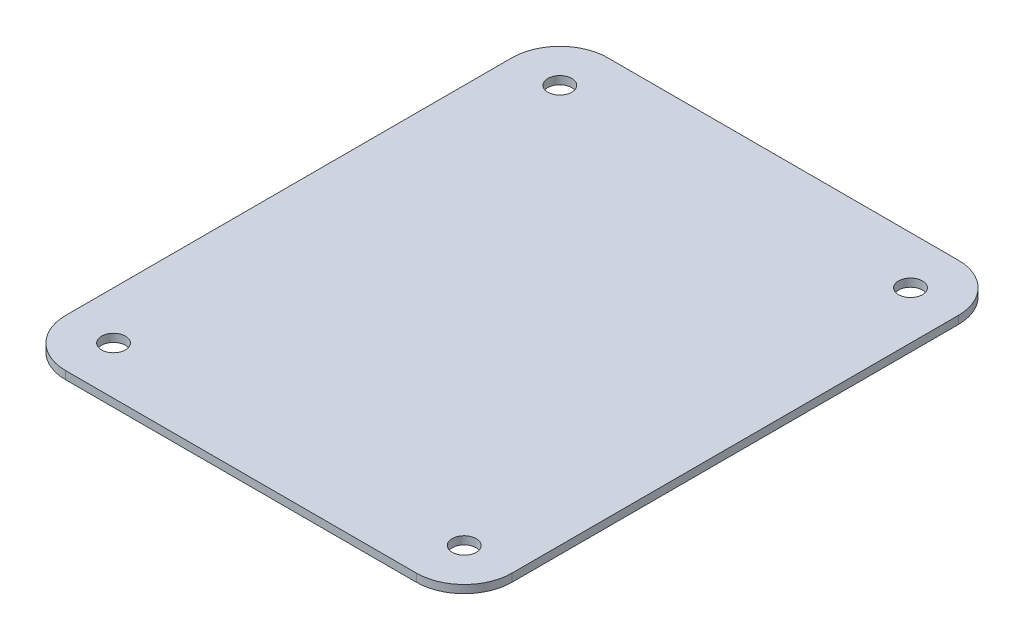
ISO-10303-21;
HEADER;
FILE_DESCRIPTION(('STEP AP214'),'2;1');
FILE_NAME('part.step','',(''),(''),'','','');
FILE_SCHEMA(('AUTOMOTIVE_DESIGN { 1 0 10303 214 1 1 1 1 }'));
ENDSEC;
DATA;
#1=APPLICATION_CONTEXT('core data for automotive mechanical design processes');
#2=APPLICATION_PROTOCOL_DEFINITION('international standard','automotive_design',2000,#1);
#3=PRODUCT_CONTEXT('',#1,'mechanical');
#4=PRODUCT('Part','Part','',(#3));
#5=PRODUCT_RELATED_PRODUCT_CATEGORY('part','',(#4));
#6=PRODUCT_DEFINITION_FORMATION('','',#4);
#7=PRODUCT_DEFINITION_CONTEXT('part definition',#1,'design');
#8=PRODUCT_DEFINITION('design','',#6,#7);
#9=PRODUCT_DEFINITION_SHAPE('','',#8);
#10=(LENGTH_UNIT() NAMED_UNIT(*) SI_UNIT(.MILLI.,.METRE.));
#11=(NAMED_UNIT(*) PLANE_ANGLE_UNIT() SI_UNIT($,.RADIAN.));
#12=(NAMED_UNIT(*) SI_UNIT($,.STERADIAN.) SOLID_ANGLE_UNIT());
#13=UNCERTAINTY_MEASURE_WITH_UNIT(LENGTH_MEASURE(1.E-05),#10,'distance_accuracy_value','');
#14=(GEOMETRIC_REPRESENTATION_CONTEXT(3) GLOBAL_UNCERTAINTY_ASSIGNED_CONTEXT((#13)) GLOBAL_UNIT_ASSIGNED_CONTEXT((#10,
#11,#12)) REPRESENTATION_CONTEXT('',''));
#15=CARTESIAN_POINT('',(0.,0.,0.));
#16=DIRECTION('',(0.,0.,1.));
#17=DIRECTION('',(1.,0.,0.));
#18=AXIS2_PLACEMENT_3D('',#15,#16,#17);
#19=CARTESIAN_POINT('',(-69.85,-3.175,88.9));
#20=DIRECTION('',(0.,1.,0.));
#21=DIRECTION('',(0.,0.,1.));
#22=AXIS2_PLACEMENT_3D('',#19,#20,#21);
#23=CYLINDRICAL_SURFACE('',#22,19.05);
#24=CARTESIAN_POINT('',(-69.85,0.,88.9));
#25=DIRECTION('',(0.,1.,0.));
#26=DIRECTION('',(0.,0.,-1.));
#27=AXIS2_PLACEMENT_3D('',#24,#25,#26);
#28=CIRCLE('',#27,19.05);
#29=CARTESIAN_POINT('',(-88.9,0.,88.8999999999998));
#30=VERTEX_POINT('',#29);
#31=CARTESIAN_POINT('',(-69.8499999999999,0.,107.95));
#32=VERTEX_POINT('',#31);
#33=EDGE_CURVE('E142',#30,#32,#28,.T.);
#34=ORIENTED_EDGE('',*,*,#33,.F.);
#35=DIRECTION('',(0.,1.,0.));
#36=VECTOR('',#35,1.);
#37=CARTESIAN_POINT('',(-88.9,-3.175,88.8999999999998));
#38=LINE('',#37,#36);
#39=CARTESIAN_POINT('',(-88.9,-3.175,88.8999999999998));
#40=VERTEX_POINT('',#39);
#41=EDGE_CURVE('E11',#40,#30,#38,.T.);
#42=ORIENTED_EDGE('',*,*,#41,.F.);
#43=CARTESIAN_POINT('',(-69.85,-3.175,88.9));
#44=DIRECTION('',(0.,1.,0.));
#45=DIRECTION('',(0.,0.,-1.));
#46=AXIS2_PLACEMENT_3D('',#43,#44,#45);
#47=CIRCLE('',#46,19.05);
#48=CARTESIAN_POINT('',(-69.8499999999999,-3.175,107.95));
#49=VERTEX_POINT('',#48);
#50=EDGE_CURVE('E163',#40,#49,#47,.T.);
#51=ORIENTED_EDGE('',*,*,#50,.T.);
#52=DIRECTION('',(0.,1.,0.));
#53=VECTOR('',#52,1.);
#54=CARTESIAN_POINT('',(-69.8499999999999,-3.175,107.95));
#55=LINE('',#54,#53);
#56=EDGE_CURVE('E48',#49,#32,#55,.T.);
#57=ORIENTED_EDGE('',*,*,#56,.T.);
#58=EDGE_LOOP('',(#34,#42,#51,#57));
#59=FACE_BOUND('',#58,.T.);
#60=ADVANCED_FACE('F45',(#59),#23,.T.);
#61=CARTESIAN_POINT('',(-88.9,-3.175,88.8999999999998));
#62=DIRECTION('',(-1.,0.,0.));
#63=DIRECTION('',(0.,0.,1.));
#64=AXIS2_PLACEMENT_3D('',#61,#62,#63);
#65=PLANE('',#64);
#66=DIRECTION('',(0.,0.,1.));
#67=VECTOR('',#66,1.);
#68=CARTESIAN_POINT('',(-88.9,0.,88.8999999999998));
#69=LINE('',#68,#67);
#70=CARTESIAN_POINT('',(-88.9,0.,-88.8999999999998));
#71=VERTEX_POINT('',#70);
#72=EDGE_CURVE('E161',#71,#30,#69,.T.);
#73=ORIENTED_EDGE('',*,*,#72,.F.);
#74=DIRECTION('',(0.,1.,0.));
#75=VECTOR('',#74,1.);
#76=CARTESIAN_POINT('',(-88.9,-3.175,-88.8999999999998));
#77=LINE('',#76,#75);
#78=CARTESIAN_POINT('',(-88.9,-3.175,-88.8999999999998));
#79=VERTEX_POINT('',#78);
#80=EDGE_CURVE('E54',#79,#71,#77,.T.);
#81=ORIENTED_EDGE('',*,*,#80,.F.);
#82=DIRECTION('',(0.,0.,1.));
#83=VECTOR('',#82,1.);
#84=CARTESIAN_POINT('',(-88.9,-3.175,88.8999999999998));
#85=LINE('',#84,#83);
#86=EDGE_CURVE('E132',#79,#40,#85,.T.);
#87=ORIENTED_EDGE('',*,*,#86,.T.);
#88=ORIENTED_EDGE('',*,*,#41,.T.);
#89=EDGE_LOOP('',(#73,#81,#87,#88));
#90=FACE_BOUND('',#89,.T.);
#91=ADVANCED_FACE('F175',(#90),#65,.T.);
#92=CARTESIAN_POINT('',(-69.85,-3.175,-88.9));
#93=DIRECTION('',(0.,1.,0.));
#94=DIRECTION('',(0.,0.,1.));
#95=AXIS2_PLACEMENT_3D('',#92,#93,#94);
#96=CYLINDRICAL_SURFACE('',#95,19.05);
#97=CARTESIAN_POINT('',(-69.85,0.,-88.9));
#98=DIRECTION('',(0.,1.,0.));
#99=DIRECTION('',(0.,0.,-1.));
#100=AXIS2_PLACEMENT_3D('',#97,#98,#99);
#101=CIRCLE('',#100,19.05);
#102=CARTESIAN_POINT('',(-69.8499999999999,0.,-107.95));
#103=VERTEX_POINT('',#102);
#104=EDGE_CURVE('E119',#103,#71,#101,.T.);
#105=ORIENTED_EDGE('',*,*,#104,.F.);
#106=DIRECTION('',(0.,1.,0.));
#107=VECTOR('',#106,1.);
#108=CARTESIAN_POINT('',(-69.8499999999999,-3.175,-107.95));
#109=LINE('',#108,#107);
#110=CARTESIAN_POINT('',(-69.8499999999999,-3.175,-107.95));
#111=VERTEX_POINT('',#110);
#112=EDGE_CURVE('E114',#111,#103,#109,.T.);
#113=ORIENTED_EDGE('',*,*,#112,.F.);
#114=CARTESIAN_POINT('',(-69.85,-3.175,-88.9));
#115=DIRECTION('',(0.,1.,0.));
#116=DIRECTION('',(0.,0.,-1.));
#117=AXIS2_PLACEMENT_3D('',#114,#115,#116);
#118=CIRCLE('',#117,19.05);
#119=EDGE_CURVE('E117',#111,#79,#118,.T.);
#120=ORIENTED_EDGE('',*,*,#119,.T.);
#121=ORIENTED_EDGE('',*,*,#80,.T.);
#122=EDGE_LOOP('',(#105,#113,#120,#121));
#123=FACE_BOUND('',#122,.T.);
#124=ADVANCED_FACE('F116',(#123),#96,.T.);
#125=CARTESIAN_POINT('',(-69.8499999999999,-3.175,-107.95));
#126=DIRECTION('',(0.,0.,-1.));
#127=DIRECTION('',(-1.,0.,0.));
#128=AXIS2_PLACEMENT_3D('',#125,#126,#127);
#129=PLANE('',#128);
#130=DIRECTION('',(-1.,0.,0.));
#131=VECTOR('',#130,1.);
#132=CARTESIAN_POINT('',(-69.8499999999999,0.,-107.95));
#133=LINE('',#132,#131);
#134=CARTESIAN_POINT('',(69.8499999999998,0.,-107.95));
#135=VERTEX_POINT('',#134);
#136=EDGE_CURVE('E158',#135,#103,#133,.T.);
#137=ORIENTED_EDGE('',*,*,#136,.F.);
#138=DIRECTION('',(0.,1.,0.));
#139=VECTOR('',#138,1.);
#140=CARTESIAN_POINT('',(69.8499999999998,-3.175,-107.95));
#141=LINE('',#140,#139);
#142=CARTESIAN_POINT('',(69.8499999999998,-3.175,-107.95));
#143=VERTEX_POINT('',#142);
#144=EDGE_CURVE('E124',#143,#135,#141,.T.);
#145=ORIENTED_EDGE('',*,*,#144,.F.);
#146=DIRECTION('',(-1.,0.,0.));
#147=VECTOR('',#146,1.);
#148=CARTESIAN_POINT('',(-69.8499999999999,-3.175,-107.95));
#149=LINE('',#148,#147);
#150=EDGE_CURVE('E130',#143,#111,#149,.T.);
#151=ORIENTED_EDGE('',*,*,#150,.T.);
#152=ORIENTED_EDGE('',*,*,#112,.T.);
#153=EDGE_LOOP('',(#137,#145,#151,#152));
#154=FACE_BOUND('',#153,.T.);
#155=ADVANCED_FACE('F134',(#154),#129,.T.);
#156=CARTESIAN_POINT('',(69.85,-3.175,-88.9));
#157=DIRECTION('',(0.,1.,0.));
#158=DIRECTION('',(0.,0.,1.));
#159=AXIS2_PLACEMENT_3D('',#156,#157,#158);
#160=CYLINDRICAL_SURFACE('',#159,19.05);
#161=CARTESIAN_POINT('',(69.85,0.,-88.9));
#162=DIRECTION('',(0.,1.,0.));
#163=DIRECTION('',(0.,0.,-1.));
#164=AXIS2_PLACEMENT_3D('',#161,#162,#163);
#165=CIRCLE('',#164,19.05);
#166=CARTESIAN_POINT('',(88.9,0.,-88.8999999999998));
#167=VERTEX_POINT('',#166);
#168=EDGE_CURVE('E155',#167,#135,#165,.T.);
#169=ORIENTED_EDGE('',*,*,#168,.F.);
#170=DIRECTION('',(0.,1.,0.));
#171=VECTOR('',#170,1.);
#172=CARTESIAN_POINT('',(88.9,-3.175,-88.8999999999998));
#173=LINE('',#172,#171);
#174=CARTESIAN_POINT('',(88.9,-3.175,-88.8999999999998));
#175=VERTEX_POINT('',#174);
#176=EDGE_CURVE('E167',#175,#167,#173,.T.);
#177=ORIENTED_EDGE('',*,*,#176,.F.);
#178=CARTESIAN_POINT('',(69.85,-3.175,-88.9));
#179=DIRECTION('',(0.,1.,0.));
#180=DIRECTION('',(0.,0.,-1.));
#181=AXIS2_PLACEMENT_3D('',#178,#179,#180);
#182=CIRCLE('',#181,19.05);
#183=EDGE_CURVE('E135',#175,#143,#182,.T.);
#184=ORIENTED_EDGE('',*,*,#183,.T.);
#185=ORIENTED_EDGE('',*,*,#144,.T.);
#186=EDGE_LOOP('',(#169,#177,#184,#185));
#187=FACE_BOUND('',#186,.T.);
#188=ADVANCED_FACE('F188',(#187),#160,.T.);
#189=CARTESIAN_POINT('',(88.9,-3.175,88.8999999999998));
#190=DIRECTION('',(1.,0.,0.));
#191=DIRECTION('',(0.,0.,-1.));
#192=AXIS2_PLACEMENT_3D('',#189,#190,#191);
#193=PLANE('',#192);
#194=DIRECTION('',(0.,0.,-1.));
#195=VECTOR('',#194,1.);
#196=CARTESIAN_POINT('',(88.9,0.,88.8999999999998));
#197=LINE('',#196,#195);
#198=CARTESIAN_POINT('',(88.9,0.,88.8999999999998));
#199=VERTEX_POINT('',#198);
#200=EDGE_CURVE('E152',#199,#167,#197,.T.);
#201=ORIENTED_EDGE('',*,*,#200,.F.);
#202=DIRECTION('',(0.,1.,0.));
#203=VECTOR('',#202,1.);
#204=CARTESIAN_POINT('',(88.9,-3.175,88.8999999999998));
#205=LINE('',#204,#203);
#206=CARTESIAN_POINT('',(88.9,-3.175,88.8999999999998));
#207=VERTEX_POINT('',#206);
#208=EDGE_CURVE('E169',#207,#199,#205,.T.);
#209=ORIENTED_EDGE('',*,*,#208,.F.);
#210=DIRECTION('',(0.,0.,-1.));
#211=VECTOR('',#210,1.);
#212=CARTESIAN_POINT('',(88.9,-3.175,88.8999999999998));
#213=LINE('',#212,#211);
#214=EDGE_CURVE('E137',#207,#175,#213,.T.);
#215=ORIENTED_EDGE('',*,*,#214,.T.);
#216=ORIENTED_EDGE('',*,*,#176,.T.);
#217=EDGE_LOOP('',(#201,#209,#215,#216));
#218=FACE_BOUND('',#217,.T.);
#219=ADVANCED_FACE('F191',(#218),#193,.T.);
#220=CARTESIAN_POINT('',(69.85,-3.175,88.9));
#221=DIRECTION('',(0.,1.,0.));
#222=DIRECTION('',(0.,0.,1.));
#223=AXIS2_PLACEMENT_3D('',#220,#221,#222);
#224=CYLINDRICAL_SURFACE('',#223,19.05);
#225=CARTESIAN_POINT('',(69.85,0.,88.9));
#226=DIRECTION('',(0.,1.,0.));
#227=DIRECTION('',(0.,0.,1.));
#228=AXIS2_PLACEMENT_3D('',#225,#226,#227);
#229=CIRCLE('',#228,19.05);
#230=CARTESIAN_POINT('',(69.8499999999998,0.,107.95));
#231=VERTEX_POINT('',#230);
#232=EDGE_CURVE('E149',#231,#199,#229,.T.);
#233=ORIENTED_EDGE('',*,*,#232,.F.);
#234=DIRECTION('',(0.,1.,0.));
#235=VECTOR('',#234,1.);
#236=CARTESIAN_POINT('',(69.8499999999998,-3.175,107.95));
#237=LINE('',#236,#235);
#238=CARTESIAN_POINT('',(69.8499999999998,-3.175,107.95));
#239=VERTEX_POINT('',#238);
#240=EDGE_CURVE('E170',#239,#231,#237,.T.);
#241=ORIENTED_EDGE('',*,*,#240,.F.);
#242=CARTESIAN_POINT('',(69.85,-3.175,88.9));
#243=DIRECTION('',(0.,1.,0.));
#244=DIRECTION('',(0.,0.,1.));
#245=AXIS2_PLACEMENT_3D('',#242,#243,#244);
#246=CIRCLE('',#245,19.05);
#247=EDGE_CURVE('E258',#239,#207,#246,.T.);
#248=ORIENTED_EDGE('',*,*,#247,.T.);
#249=ORIENTED_EDGE('',*,*,#208,.T.);
#250=EDGE_LOOP('',(#233,#241,#248,#249));
#251=FACE_BOUND('',#250,.T.);
#252=ADVANCED_FACE('F195',(#251),#224,.T.);
#253=CARTESIAN_POINT('',(-69.8499999999999,-3.175,107.95));
#254=DIRECTION('',(0.,0.,1.));
#255=DIRECTION('',(1.,0.,0.));
#256=AXIS2_PLACEMENT_3D('',#253,#254,#255);
#257=PLANE('',#256);
#258=DIRECTION('',(1.,0.,0.));
#259=VECTOR('',#258,1.);
#260=CARTESIAN_POINT('',(-69.8499999999999,0.,107.95));
#261=LINE('',#260,#259);
#262=EDGE_CURVE('E145',#32,#231,#261,.T.);
#263=ORIENTED_EDGE('',*,*,#262,.F.);
#264=ORIENTED_EDGE('',*,*,#56,.F.);
#265=DIRECTION('',(1.,0.,0.));
#266=VECTOR('',#265,1.);
#267=CARTESIAN_POINT('',(-69.8499999999999,-3.175,107.95));
#268=LINE('',#267,#266);
#269=EDGE_CURVE('E256',#49,#239,#268,.T.);
#270=ORIENTED_EDGE('',*,*,#269,.T.);
#271=ORIENTED_EDGE('',*,*,#240,.T.);
#272=EDGE_LOOP('',(#263,#264,#270,#271));
#273=FACE_BOUND('',#272,.T.);
#274=ADVANCED_FACE('F172',(#273),#257,.T.);
#275=CARTESIAN_POINT('',(-69.85,-3.175,88.9));
#276=DIRECTION('',(0.,-1.,0.));
#277=DIRECTION('',(0.,0.,-1.));
#278=AXIS2_PLACEMENT_3D('',#275,#276,#277);
#279=PLANE('',#278);
#280=CARTESIAN_POINT('',(-69.85,-3.175,-88.9));
#281=DIRECTION('',(0.,1.,0.));
#282=DIRECTION('',(0.,0.,1.));
#283=AXIS2_PLACEMENT_3D('',#280,#281,#282);
#284=CIRCLE('',#283,4.7625);
#285=CARTESIAN_POINT('',(-69.85,-3.175,-84.1375));
#286=VERTEX_POINT('',#285);
#287=EDGE_CURVE('E251',#286,#286,#284,.T.);
#288=ORIENTED_EDGE('',*,*,#287,.T.);
#289=EDGE_LOOP('',(#288));
#290=FACE_BOUND('',#289,.T.);
#291=CARTESIAN_POINT('',(69.85,-3.175,-88.9));
#292=DIRECTION('',(0.,1.,0.));
#293=DIRECTION('',(0.,0.,1.));
#294=AXIS2_PLACEMENT_3D('',#291,#292,#293);
#295=CIRCLE('',#294,4.7625);
#296=CARTESIAN_POINT('',(69.85,-3.175,-84.1375));
#297=VERTEX_POINT('',#296);
#298=EDGE_CURVE('E245',#297,#297,#295,.T.);
#299=ORIENTED_EDGE('',*,*,#298,.T.);
#300=EDGE_LOOP('',(#299));
#301=FACE_BOUND('',#300,.T.);
#302=CARTESIAN_POINT('',(69.85,-3.175,88.9));
#303=DIRECTION('',(0.,1.,0.));
#304=DIRECTION('',(0.,0.,1.));
#305=AXIS2_PLACEMENT_3D('',#302,#303,#304);
#306=CIRCLE('',#305,4.7625);
#307=CARTESIAN_POINT('',(69.85,-3.175,93.6625));
#308=VERTEX_POINT('',#307);
#309=EDGE_CURVE('E231',#308,#308,#306,.T.);
#310=ORIENTED_EDGE('',*,*,#309,.T.);
#311=EDGE_LOOP('',(#310));
#312=FACE_BOUND('',#311,.T.);
#313=CARTESIAN_POINT('',(-69.85,-3.175,88.9));
#314=DIRECTION('',(0.,1.,0.));
#315=DIRECTION('',(0.,0.,1.));
#316=AXIS2_PLACEMENT_3D('',#313,#314,#315);
#317=CIRCLE('',#316,4.7625);
#318=CARTESIAN_POINT('',(-69.85,-3.175,93.6625));
#319=VERTEX_POINT('',#318);
#320=EDGE_CURVE('E146',#319,#319,#317,.T.);
#321=ORIENTED_EDGE('',*,*,#320,.T.);
#322=EDGE_LOOP('',(#321));
#323=FACE_BOUND('',#322,.T.);
#324=ORIENTED_EDGE('',*,*,#50,.F.);
#325=ORIENTED_EDGE('',*,*,#86,.F.);
#326=ORIENTED_EDGE('',*,*,#119,.F.);
#327=ORIENTED_EDGE('',*,*,#150,.F.);
#328=ORIENTED_EDGE('',*,*,#183,.F.);
#329=ORIENTED_EDGE('',*,*,#214,.F.);
#330=ORIENTED_EDGE('',*,*,#247,.F.);
#331=ORIENTED_EDGE('',*,*,#269,.F.);
#332=EDGE_LOOP('',(#324,#325,#326,#327,#328,#329,#330,#331));
#333=FACE_BOUND('',#332,.T.);
#334=ADVANCED_FACE('F128',(#290,#301,#312,#323,#333),#279,.T.);
#335=CARTESIAN_POINT('',(-69.85,0.,88.9));
#336=DIRECTION('',(0.,-1.,0.));
#337=DIRECTION('',(0.,0.,-1.));
#338=AXIS2_PLACEMENT_3D('',#335,#336,#337);
#339=PLANE('',#338);
#340=CARTESIAN_POINT('',(-69.85,0.,-88.9));
#341=DIRECTION('',(0.,1.,0.));
#342=DIRECTION('',(0.,0.,1.));
#343=AXIS2_PLACEMENT_3D('',#340,#341,#342);
#344=CIRCLE('',#343,4.7625);
#345=CARTESIAN_POINT('',(-69.85,0.,-84.1375));
#346=VERTEX_POINT('',#345);
#347=EDGE_CURVE('E248',#346,#346,#344,.T.);
#348=ORIENTED_EDGE('',*,*,#347,.F.);
#349=EDGE_LOOP('',(#348));
#350=FACE_BOUND('',#349,.T.);
#351=CARTESIAN_POINT('',(69.85,0.,-88.9));
#352=DIRECTION('',(0.,1.,0.));
#353=DIRECTION('',(0.,0.,1.));
#354=AXIS2_PLACEMENT_3D('',#351,#352,#353);
#355=CIRCLE('',#354,4.7625);
#356=CARTESIAN_POINT('',(69.85,0.,-84.1375));
#357=VERTEX_POINT('',#356);
#358=EDGE_CURVE('E240',#357,#357,#355,.T.);
#359=ORIENTED_EDGE('',*,*,#358,.F.);
#360=EDGE_LOOP('',(#359));
#361=FACE_BOUND('',#360,.T.);
#362=CARTESIAN_POINT('',(69.85,0.,88.9));
#363=DIRECTION('',(0.,1.,0.));
#364=DIRECTION('',(0.,0.,1.));
#365=AXIS2_PLACEMENT_3D('',#362,#363,#364);
#366=CIRCLE('',#365,4.7625);
#367=CARTESIAN_POINT('',(69.85,0.,93.6625));
#368=VERTEX_POINT('',#367);
#369=EDGE_CURVE('E234',#368,#368,#366,.T.);
#370=ORIENTED_EDGE('',*,*,#369,.F.);
#371=EDGE_LOOP('',(#370));
#372=FACE_BOUND('',#371,.T.);
#373=CARTESIAN_POINT('',(-69.85,0.,88.9));
#374=DIRECTION('',(0.,1.,0.));
#375=DIRECTION('',(0.,0.,1.));
#376=AXIS2_PLACEMENT_3D('',#373,#374,#375);
#377=CIRCLE('',#376,4.7625);
#378=CARTESIAN_POINT('',(-69.85,0.,93.6625));
#379=VERTEX_POINT('',#378);
#380=EDGE_CURVE('E236',#379,#379,#377,.T.);
#381=ORIENTED_EDGE('',*,*,#380,.F.);
#382=EDGE_LOOP('',(#381));
#383=FACE_BOUND('',#382,.T.);
#384=ORIENTED_EDGE('',*,*,#33,.T.);
#385=ORIENTED_EDGE('',*,*,#262,.T.);
#386=ORIENTED_EDGE('',*,*,#232,.T.);
#387=ORIENTED_EDGE('',*,*,#200,.T.);
#388=ORIENTED_EDGE('',*,*,#168,.T.);
#389=ORIENTED_EDGE('',*,*,#136,.T.);
#390=ORIENTED_EDGE('',*,*,#104,.T.);
#391=ORIENTED_EDGE('',*,*,#72,.T.);
#392=EDGE_LOOP('',(#384,#385,#386,#387,#388,#389,#390,#391));
#393=FACE_BOUND('',#392,.T.);
#394=ADVANCED_FACE('F174',(#350,#361,#372,#383,#393),#339,.F.);
#395=CARTESIAN_POINT('',(-69.85,-3.175,88.9));
#396=DIRECTION('',(0.,1.,0.));
#397=DIRECTION('',(0.,0.,1.));
#398=AXIS2_PLACEMENT_3D('',#395,#396,#397);
#399=CYLINDRICAL_SURFACE('',#398,4.7625);
#400=ORIENTED_EDGE('',*,*,#320,.F.);
#401=EDGE_LOOP('',(#400));
#402=FACE_BOUND('',#401,.T.);
#403=ORIENTED_EDGE('',*,*,#380,.T.);
#404=EDGE_LOOP('',(#403));
#405=FACE_BOUND('',#404,.T.);
#406=ADVANCED_FACE('F207',(#402,#405),#399,.F.);
#407=CARTESIAN_POINT('',(69.85,-3.175,88.9));
#408=DIRECTION('',(0.,1.,0.));
#409=DIRECTION('',(0.,0.,1.));
#410=AXIS2_PLACEMENT_3D('',#407,#408,#409);
#411=CYLINDRICAL_SURFACE('',#410,4.7625);
#412=ORIENTED_EDGE('',*,*,#309,.F.);
#413=EDGE_LOOP('',(#412));
#414=FACE_BOUND('',#413,.T.);
#415=ORIENTED_EDGE('',*,*,#369,.T.);
#416=EDGE_LOOP('',(#415));
#417=FACE_BOUND('',#416,.T.);
#418=ADVANCED_FACE('F214',(#414,#417),#411,.F.);
#419=CARTESIAN_POINT('',(69.85,-3.175,-88.9));
#420=DIRECTION('',(0.,1.,0.));
#421=DIRECTION('',(0.,0.,1.));
#422=AXIS2_PLACEMENT_3D('',#419,#420,#421);
#423=CYLINDRICAL_SURFACE('',#422,4.7625);
#424=ORIENTED_EDGE('',*,*,#298,.F.);
#425=EDGE_LOOP('',(#424));
#426=FACE_BOUND('',#425,.T.);
#427=ORIENTED_EDGE('',*,*,#358,.T.);
#428=EDGE_LOOP('',(#427));
#429=FACE_BOUND('',#428,.T.);
#430=ADVANCED_FACE('F219',(#426,#429),#423,.F.);
#431=CARTESIAN_POINT('',(-69.85,-3.175,-88.9));
#432=DIRECTION('',(0.,1.,0.));
#433=DIRECTION('',(0.,0.,1.));
#434=AXIS2_PLACEMENT_3D('',#431,#432,#433);
#435=CYLINDRICAL_SURFACE('',#434,4.7625);
#436=ORIENTED_EDGE('',*,*,#287,.F.);
#437=EDGE_LOOP('',(#436));
#438=FACE_BOUND('',#437,.T.);
#439=ORIENTED_EDGE('',*,*,#347,.T.);
#440=EDGE_LOOP('',(#439));
#441=FACE_BOUND('',#440,.T.);
#442=ADVANCED_FACE('F216',(#438,#441),#435,.F.);
#443=CLOSED_SHELL('',(#60,#91,#124,#155,#188,#219,#252,#274,#334,#394,#406,#418,#430,#442));
#444=MANIFOLD_SOLID_BREP('B2',#443);
#445=ADVANCED_BREP_SHAPE_REPRESENTATION('',(#18,#444),#14);
#446=SHAPE_DEFINITION_REPRESENTATION(#9,#445);
ENDSEC;
END-ISO-10303-21;
